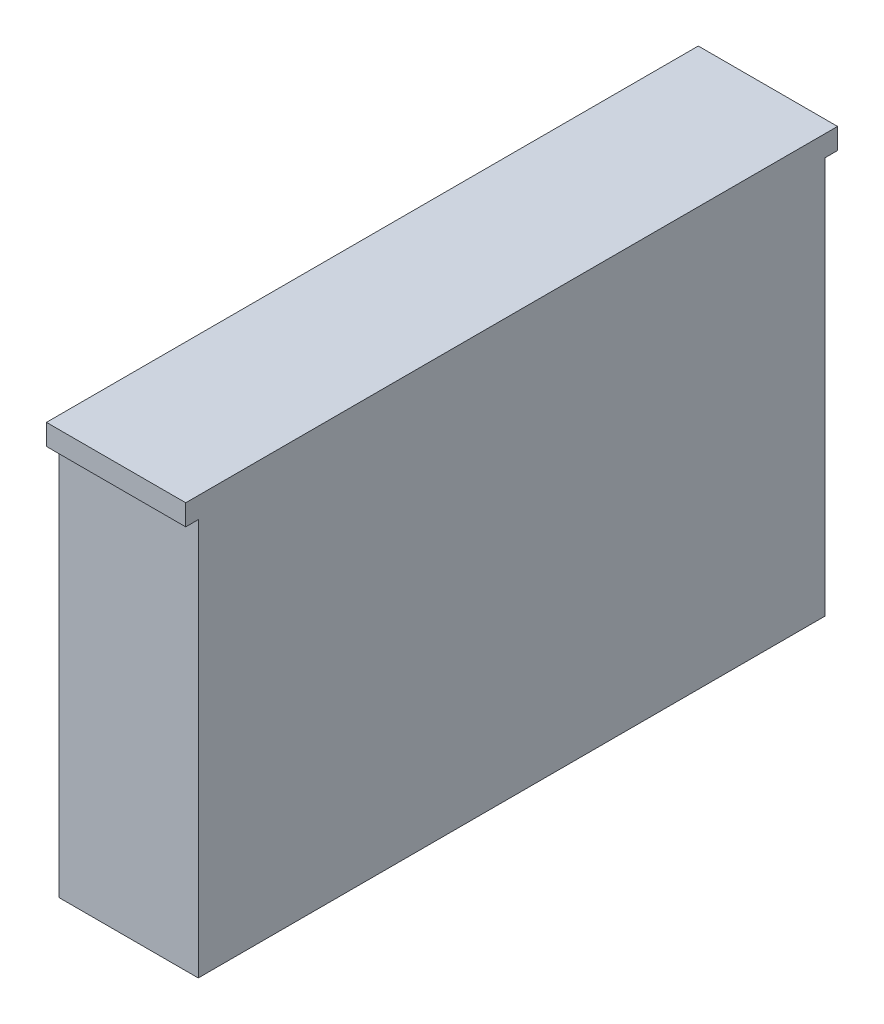
ISO-10303-21;
HEADER;
FILE_DESCRIPTION(('STEP AP214'),'2;1');
FILE_NAME('part.step','',(''),(''),'','','');
FILE_SCHEMA(('AUTOMOTIVE_DESIGN { 1 0 10303 214 1 1 1 1 }'));
ENDSEC;
DATA;
#1=APPLICATION_CONTEXT('core data for automotive mechanical design processes');
#2=APPLICATION_PROTOCOL_DEFINITION('international standard','automotive_design',2000,#1);
#3=PRODUCT_CONTEXT('',#1,'mechanical');
#4=PRODUCT('Part','Part','',(#3));
#5=PRODUCT_RELATED_PRODUCT_CATEGORY('part','',(#4));
#6=PRODUCT_DEFINITION_FORMATION('','',#4);
#7=PRODUCT_DEFINITION_CONTEXT('part definition',#1,'design');
#8=PRODUCT_DEFINITION('design','',#6,#7);
#9=PRODUCT_DEFINITION_SHAPE('','',#8);
#10=(LENGTH_UNIT() NAMED_UNIT(*) SI_UNIT(.MILLI.,.METRE.));
#11=(NAMED_UNIT(*) PLANE_ANGLE_UNIT() SI_UNIT($,.RADIAN.));
#12=(NAMED_UNIT(*) SI_UNIT($,.STERADIAN.) SOLID_ANGLE_UNIT());
#13=UNCERTAINTY_MEASURE_WITH_UNIT(LENGTH_MEASURE(1.E-05),#10,'distance_accuracy_value','');
#14=(GEOMETRIC_REPRESENTATION_CONTEXT(3) GLOBAL_UNCERTAINTY_ASSIGNED_CONTEXT((#13)) GLOBAL_UNIT_ASSIGNED_CONTEXT((#10,
#11,#12)) REPRESENTATION_CONTEXT('',''));
#15=CARTESIAN_POINT('',(0.,0.,0.));
#16=DIRECTION('',(0.,0.,1.));
#17=DIRECTION('',(1.,0.,0.));
#18=AXIS2_PLACEMENT_3D('',#15,#16,#17);
#19=CARTESIAN_POINT('',(100.,-150.,225.));
#20=DIRECTION('',(0.,0.,-1.));
#21=DIRECTION('',(-1.,0.,0.));
#22=AXIS2_PLACEMENT_3D('',#19,#20,#21);
#23=PLANE('',#22);
#24=DIRECTION('',(1.,0.,0.));
#25=VECTOR('',#24,1.);
#26=CARTESIAN_POINT('',(100.,135.,225.));
#27=LINE('',#26,#25);
#28=CARTESIAN_POINT('',(0.,135.,225.));
#29=VERTEX_POINT('',#28);
#30=CARTESIAN_POINT('',(100.,135.,225.));
#31=VERTEX_POINT('',#30);
#32=EDGE_CURVE('E50',#29,#31,#27,.T.);
#33=ORIENTED_EDGE('',*,*,#32,.F.);
#34=DIRECTION('',(0.,-1.,0.));
#35=VECTOR('',#34,1.);
#36=CARTESIAN_POINT('',(0.,-150.,225.));
#37=LINE('',#36,#35);
#38=CARTESIAN_POINT('',(0.,-150.,225.));
#39=VERTEX_POINT('',#38);
#40=EDGE_CURVE('E123',#29,#39,#37,.T.);
#41=ORIENTED_EDGE('',*,*,#40,.T.);
#42=DIRECTION('',(-1.,0.,0.));
#43=VECTOR('',#42,1.);
#44=CARTESIAN_POINT('',(100.,-150.,225.));
#45=LINE('',#44,#43);
#46=CARTESIAN_POINT('',(100.,-150.,225.));
#47=VERTEX_POINT('',#46);
#48=EDGE_CURVE('E11',#47,#39,#45,.T.);
#49=ORIENTED_EDGE('',*,*,#48,.F.);
#50=DIRECTION('',(0.,-1.,0.));
#51=VECTOR('',#50,1.);
#52=CARTESIAN_POINT('',(100.,-150.,225.));
#53=LINE('',#52,#51);
#54=EDGE_CURVE('E146',#31,#47,#53,.T.);
#55=ORIENTED_EDGE('',*,*,#54,.F.);
#56=EDGE_LOOP('',(#33,#41,#49,#55));
#57=FACE_BOUND('',#56,.T.);
#58=ADVANCED_FACE('F36',(#57),#23,.F.);
#59=CARTESIAN_POINT('',(100.,-150.,-225.));
#60=DIRECTION('',(0.,0.,1.));
#61=DIRECTION('',(1.,0.,0.));
#62=AXIS2_PLACEMENT_3D('',#59,#60,#61);
#63=PLANE('',#62);
#64=DIRECTION('',(-1.,0.,0.));
#65=VECTOR('',#64,1.);
#66=CARTESIAN_POINT('',(0.,135.,-225.));
#67=LINE('',#66,#65);
#68=CARTESIAN_POINT('',(100.,135.,-225.));
#69=VERTEX_POINT('',#68);
#70=CARTESIAN_POINT('',(0.,135.,-225.));
#71=VERTEX_POINT('',#70);
#72=EDGE_CURVE('E58',#69,#71,#67,.T.);
#73=ORIENTED_EDGE('',*,*,#72,.F.);
#74=DIRECTION('',(0.,1.,0.));
#75=VECTOR('',#74,1.);
#76=CARTESIAN_POINT('',(100.,-150.,-225.));
#77=LINE('',#76,#75);
#78=CARTESIAN_POINT('',(100.,-150.,-225.));
#79=VERTEX_POINT('',#78);
#80=EDGE_CURVE('E151',#79,#69,#77,.T.);
#81=ORIENTED_EDGE('',*,*,#80,.F.);
#82=DIRECTION('',(-1.,0.,0.));
#83=VECTOR('',#82,1.);
#84=CARTESIAN_POINT('',(100.,-150.,-225.));
#85=LINE('',#84,#83);
#86=CARTESIAN_POINT('',(0.,-150.,-225.));
#87=VERTEX_POINT('',#86);
#88=EDGE_CURVE('E43',#79,#87,#85,.T.);
#89=ORIENTED_EDGE('',*,*,#88,.T.);
#90=DIRECTION('',(0.,1.,0.));
#91=VECTOR('',#90,1.);
#92=CARTESIAN_POINT('',(0.,-150.,-225.));
#93=LINE('',#92,#91);
#94=EDGE_CURVE('E158',#87,#71,#93,.T.);
#95=ORIENTED_EDGE('',*,*,#94,.T.);
#96=EDGE_LOOP('',(#73,#81,#89,#95));
#97=FACE_BOUND('',#96,.T.);
#98=ADVANCED_FACE('F163',(#97),#63,.F.);
#99=CARTESIAN_POINT('',(100.,-150.,-225.));
#100=DIRECTION('',(0.,1.,0.));
#101=DIRECTION('',(0.,0.,1.));
#102=AXIS2_PLACEMENT_3D('',#99,#100,#101);
#103=PLANE('',#102);
#104=DIRECTION('',(0.,0.,-1.));
#105=VECTOR('',#104,1.);
#106=CARTESIAN_POINT('',(0.,-150.,-225.));
#107=LINE('',#106,#105);
#108=EDGE_CURVE('E156',#39,#87,#107,.T.);
#109=ORIENTED_EDGE('',*,*,#108,.T.);
#110=ORIENTED_EDGE('',*,*,#88,.F.);
#111=DIRECTION('',(0.,0.,-1.));
#112=VECTOR('',#111,1.);
#113=CARTESIAN_POINT('',(100.,-150.,-225.));
#114=LINE('',#113,#112);
#115=EDGE_CURVE('E148',#47,#79,#114,.T.);
#116=ORIENTED_EDGE('',*,*,#115,.F.);
#117=ORIENTED_EDGE('',*,*,#48,.T.);
#118=EDGE_LOOP('',(#109,#110,#116,#117));
#119=FACE_BOUND('',#118,.T.);
#120=ADVANCED_FACE('F175',(#119),#103,.F.);
#121=CARTESIAN_POINT('',(100.,150.,-225.));
#122=DIRECTION('',(0.,-1.,0.));
#123=DIRECTION('',(0.,0.,-1.));
#124=AXIS2_PLACEMENT_3D('',#121,#122,#123);
#125=PLANE('',#124);
#126=DIRECTION('',(0.,0.,1.));
#127=VECTOR('',#126,1.);
#128=CARTESIAN_POINT('',(0.,150.,-225.));
#129=LINE('',#128,#127);
#130=CARTESIAN_POINT('',(0.,150.,-234.));
#131=VERTEX_POINT('',#130);
#132=CARTESIAN_POINT('',(0.,150.,234.));
#133=VERTEX_POINT('',#132);
#134=EDGE_CURVE('E149',#131,#133,#129,.T.);
#135=ORIENTED_EDGE('',*,*,#134,.T.);
#136=DIRECTION('',(-1.,0.,0.));
#137=VECTOR('',#136,1.);
#138=CARTESIAN_POINT('',(0.,150.,234.));
#139=LINE('',#138,#137);
#140=CARTESIAN_POINT('',(100.,150.,234.));
#141=VERTEX_POINT('',#140);
#142=EDGE_CURVE('E118',#141,#133,#139,.T.);
#143=ORIENTED_EDGE('',*,*,#142,.F.);
#144=DIRECTION('',(0.,0.,1.));
#145=VECTOR('',#144,1.);
#146=CARTESIAN_POINT('',(100.,150.,-225.));
#147=LINE('',#146,#145);
#148=CARTESIAN_POINT('',(100.,150.,-234.));
#149=VERTEX_POINT('',#148);
#150=EDGE_CURVE('E153',#149,#141,#147,.T.);
#151=ORIENTED_EDGE('',*,*,#150,.F.);
#152=DIRECTION('',(1.,0.,0.));
#153=VECTOR('',#152,1.);
#154=CARTESIAN_POINT('',(100.,150.,-234.));
#155=LINE('',#154,#153);
#156=EDGE_CURVE('E137',#131,#149,#155,.T.);
#157=ORIENTED_EDGE('',*,*,#156,.F.);
#158=EDGE_LOOP('',(#135,#143,#151,#157));
#159=FACE_BOUND('',#158,.T.);
#160=ADVANCED_FACE('F179',(#159),#125,.F.);
#161=CARTESIAN_POINT('',(100.,0.,0.));
#162=DIRECTION('',(1.,0.,0.));
#163=DIRECTION('',(0.,0.,-1.));
#164=AXIS2_PLACEMENT_3D('',#161,#162,#163);
#165=PLANE('',#164);
#166=ORIENTED_EDGE('',*,*,#150,.T.);
#167=DIRECTION('',(0.,1.,0.));
#168=VECTOR('',#167,1.);
#169=CARTESIAN_POINT('',(100.,150.,234.));
#170=LINE('',#169,#168);
#171=CARTESIAN_POINT('',(100.,135.,234.));
#172=VERTEX_POINT('',#171);
#173=EDGE_CURVE('E111',#172,#141,#170,.T.);
#174=ORIENTED_EDGE('',*,*,#173,.F.);
#175=DIRECTION('',(0.,0.,-1.));
#176=VECTOR('',#175,1.);
#177=CARTESIAN_POINT('',(100.,135.,234.));
#178=LINE('',#177,#176);
#179=EDGE_CURVE('E107',#172,#31,#178,.T.);
#180=ORIENTED_EDGE('',*,*,#179,.T.);
#181=ORIENTED_EDGE('',*,*,#54,.T.);
#182=ORIENTED_EDGE('',*,*,#115,.T.);
#183=ORIENTED_EDGE('',*,*,#80,.T.);
#184=DIRECTION('',(0.,0.,1.));
#185=VECTOR('',#184,1.);
#186=CARTESIAN_POINT('',(100.,135.,-234.));
#187=LINE('',#186,#185);
#188=CARTESIAN_POINT('',(100.,135.,-234.));
#189=VERTEX_POINT('',#188);
#190=EDGE_CURVE('E143',#189,#69,#187,.T.);
#191=ORIENTED_EDGE('',*,*,#190,.F.);
#192=DIRECTION('',(0.,-1.,0.));
#193=VECTOR('',#192,1.);
#194=CARTESIAN_POINT('',(100.,135.,-234.));
#195=LINE('',#194,#193);
#196=EDGE_CURVE('E125',#149,#189,#195,.T.);
#197=ORIENTED_EDGE('',*,*,#196,.F.);
#198=EDGE_LOOP('',(#166,#174,#180,#181,#182,#183,#191,#197));
#199=FACE_BOUND('',#198,.T.);
#200=ADVANCED_FACE('F173',(#199),#165,.T.);
#201=CARTESIAN_POINT('',(0.,0.,0.));
#202=DIRECTION('',(1.,0.,0.));
#203=DIRECTION('',(0.,0.,-1.));
#204=AXIS2_PLACEMENT_3D('',#201,#202,#203);
#205=PLANE('',#204);
#206=ORIENTED_EDGE('',*,*,#40,.F.);
#207=DIRECTION('',(0.,0.,-1.));
#208=VECTOR('',#207,1.);
#209=CARTESIAN_POINT('',(0.,135.,234.));
#210=LINE('',#209,#208);
#211=CARTESIAN_POINT('',(0.,135.,234.));
#212=VERTEX_POINT('',#211);
#213=EDGE_CURVE('E105',#212,#29,#210,.T.);
#214=ORIENTED_EDGE('',*,*,#213,.F.);
#215=DIRECTION('',(0.,-1.,0.));
#216=VECTOR('',#215,1.);
#217=CARTESIAN_POINT('',(0.,135.,234.));
#218=LINE('',#217,#216);
#219=EDGE_CURVE('E112',#133,#212,#218,.T.);
#220=ORIENTED_EDGE('',*,*,#219,.F.);
#221=ORIENTED_EDGE('',*,*,#134,.F.);
#222=DIRECTION('',(0.,1.,0.));
#223=VECTOR('',#222,1.);
#224=CARTESIAN_POINT('',(0.,150.,-234.));
#225=LINE('',#224,#223);
#226=CARTESIAN_POINT('',(0.,135.,-234.));
#227=VERTEX_POINT('',#226);
#228=EDGE_CURVE('E134',#227,#131,#225,.T.);
#229=ORIENTED_EDGE('',*,*,#228,.F.);
#230=DIRECTION('',(0.,0.,1.));
#231=VECTOR('',#230,1.);
#232=CARTESIAN_POINT('',(0.,135.,-234.));
#233=LINE('',#232,#231);
#234=EDGE_CURVE('E139',#227,#71,#233,.T.);
#235=ORIENTED_EDGE('',*,*,#234,.T.);
#236=ORIENTED_EDGE('',*,*,#94,.F.);
#237=ORIENTED_EDGE('',*,*,#108,.F.);
#238=EDGE_LOOP('',(#206,#214,#220,#221,#229,#235,#236,#237));
#239=FACE_BOUND('',#238,.T.);
#240=ADVANCED_FACE('F121',(#239),#205,.F.);
#241=CARTESIAN_POINT('',(0.,135.,-234.));
#242=DIRECTION('',(0.,1.,0.));
#243=DIRECTION('',(0.,0.,1.));
#244=AXIS2_PLACEMENT_3D('',#241,#242,#243);
#245=PLANE('',#244);
#246=ORIENTED_EDGE('',*,*,#72,.T.);
#247=ORIENTED_EDGE('',*,*,#234,.F.);
#248=DIRECTION('',(-1.,0.,0.));
#249=VECTOR('',#248,1.);
#250=CARTESIAN_POINT('',(0.,135.,-234.));
#251=LINE('',#250,#249);
#252=EDGE_CURVE('E132',#189,#227,#251,.T.);
#253=ORIENTED_EDGE('',*,*,#252,.F.);
#254=ORIENTED_EDGE('',*,*,#190,.T.);
#255=EDGE_LOOP('',(#246,#247,#253,#254));
#256=FACE_BOUND('',#255,.T.);
#257=ADVANCED_FACE('F169',(#256),#245,.F.);
#258=CARTESIAN_POINT('',(0.,0.,-234.));
#259=DIRECTION('',(0.,0.,1.));
#260=DIRECTION('',(1.,0.,0.));
#261=AXIS2_PLACEMENT_3D('',#258,#259,#260);
#262=PLANE('',#261);
#263=ORIENTED_EDGE('',*,*,#196,.T.);
#264=ORIENTED_EDGE('',*,*,#252,.T.);
#265=ORIENTED_EDGE('',*,*,#228,.T.);
#266=ORIENTED_EDGE('',*,*,#156,.T.);
#267=EDGE_LOOP('',(#263,#264,#265,#266));
#268=FACE_BOUND('',#267,.T.);
#269=ADVANCED_FACE('F182',(#268),#262,.F.);
#270=CARTESIAN_POINT('',(100.,135.,234.));
#271=DIRECTION('',(0.,1.,0.));
#272=DIRECTION('',(0.,0.,1.));
#273=AXIS2_PLACEMENT_3D('',#270,#271,#272);
#274=PLANE('',#273);
#275=ORIENTED_EDGE('',*,*,#32,.T.);
#276=ORIENTED_EDGE('',*,*,#179,.F.);
#277=DIRECTION('',(1.,0.,0.));
#278=VECTOR('',#277,1.);
#279=CARTESIAN_POINT('',(100.,135.,234.));
#280=LINE('',#279,#278);
#281=EDGE_CURVE('E101',#212,#172,#280,.T.);
#282=ORIENTED_EDGE('',*,*,#281,.F.);
#283=ORIENTED_EDGE('',*,*,#213,.T.);
#284=EDGE_LOOP('',(#275,#276,#282,#283));
#285=FACE_BOUND('',#284,.T.);
#286=ADVANCED_FACE('F103',(#285),#274,.F.);
#287=CARTESIAN_POINT('',(0.,0.,234.));
#288=DIRECTION('',(0.,0.,-1.));
#289=DIRECTION('',(-1.,0.,0.));
#290=AXIS2_PLACEMENT_3D('',#287,#288,#289);
#291=PLANE('',#290);
#292=ORIENTED_EDGE('',*,*,#219,.T.);
#293=ORIENTED_EDGE('',*,*,#281,.T.);
#294=ORIENTED_EDGE('',*,*,#173,.T.);
#295=ORIENTED_EDGE('',*,*,#142,.T.);
#296=EDGE_LOOP('',(#292,#293,#294,#295));
#297=FACE_BOUND('',#296,.T.);
#298=ADVANCED_FACE('F116',(#297),#291,.F.);
#299=CLOSED_SHELL('',(#58,#98,#120,#160,#200,#240,#257,#269,#286,#298));
#300=MANIFOLD_SOLID_BREP('B2',#299);
#301=ADVANCED_BREP_SHAPE_REPRESENTATION('',(#18,#300),#14);
#302=SHAPE_DEFINITION_REPRESENTATION(#9,#301);
ENDSEC;
END-ISO-10303-21;
